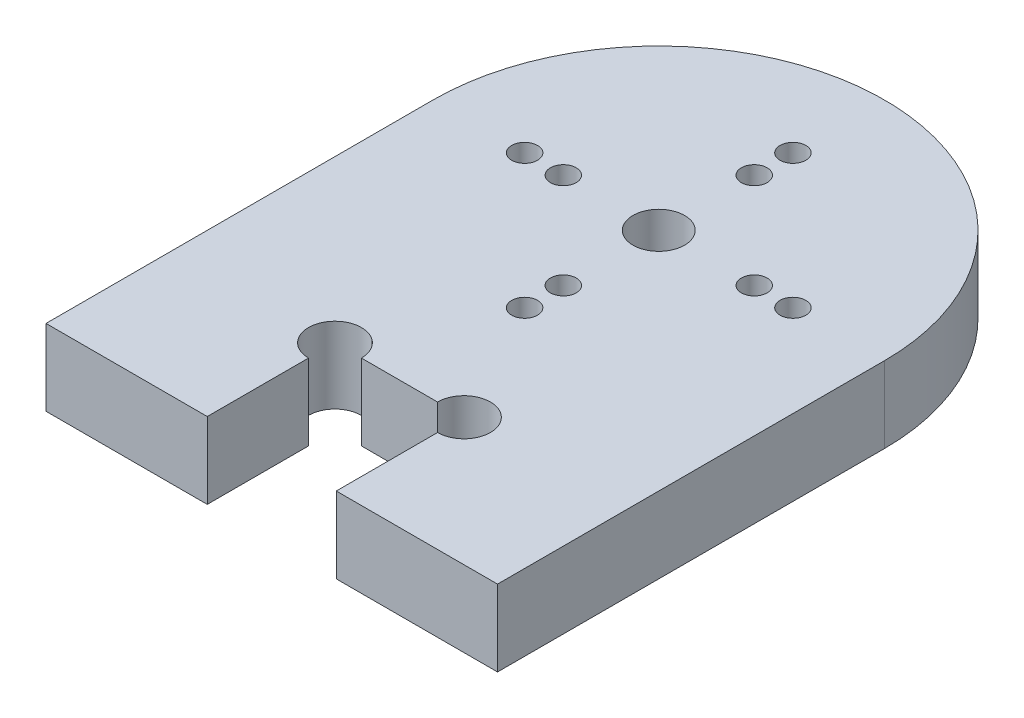
ISO-10303-21;
HEADER;
FILE_DESCRIPTION(('STEP AP214'),'2;1');
FILE_NAME('part.step','',(''),(''),'','','');
FILE_SCHEMA(('AUTOMOTIVE_DESIGN { 1 0 10303 214 1 1 1 1 }'));
ENDSEC;
DATA;
#1=APPLICATION_CONTEXT('core data for automotive mechanical design processes');
#2=APPLICATION_PROTOCOL_DEFINITION('international standard','automotive_design',2000,#1);
#3=PRODUCT_CONTEXT('',#1,'mechanical');
#4=PRODUCT('Part','Part','',(#3));
#5=PRODUCT_RELATED_PRODUCT_CATEGORY('part','',(#4));
#6=PRODUCT_DEFINITION_FORMATION('','',#4);
#7=PRODUCT_DEFINITION_CONTEXT('part definition',#1,'design');
#8=PRODUCT_DEFINITION('design','',#6,#7);
#9=PRODUCT_DEFINITION_SHAPE('','',#8);
#10=(LENGTH_UNIT() NAMED_UNIT(*) SI_UNIT(.MILLI.,.METRE.));
#11=(NAMED_UNIT(*) PLANE_ANGLE_UNIT() SI_UNIT($,.RADIAN.));
#12=(NAMED_UNIT(*) SI_UNIT($,.STERADIAN.) SOLID_ANGLE_UNIT());
#13=UNCERTAINTY_MEASURE_WITH_UNIT(LENGTH_MEASURE(1.E-05),#10,'distance_accuracy_value','');
#14=(GEOMETRIC_REPRESENTATION_CONTEXT(3) GLOBAL_UNCERTAINTY_ASSIGNED_CONTEXT((#13)) GLOBAL_UNIT_ASSIGNED_CONTEXT((#10,
#11,#12)) REPRESENTATION_CONTEXT('',''));
#15=CARTESIAN_POINT('',(0.,0.,0.));
#16=DIRECTION('',(0.,0.,1.));
#17=DIRECTION('',(1.,0.,0.));
#18=AXIS2_PLACEMENT_3D('',#15,#16,#17);
#19=CARTESIAN_POINT('',(0.,5.90000000000002,-12.5));
#20=DIRECTION('',(0.,-0.999999999999995,0.));
#21=DIRECTION('',(0.,0.,-0.999999999999995));
#22=AXIS2_PLACEMENT_3D('',#19,#20,#21);
#23=CYLINDRICAL_SURFACE('',#22,17.5);
#24=CARTESIAN_POINT('',(0.,0.,-12.5));
#25=DIRECTION('',(0.,0.999999999999995,0.));
#26=DIRECTION('',(0.,0.,0.999999999999995));
#27=AXIS2_PLACEMENT_3D('',#24,#25,#26);
#28=CIRCLE('',#27,17.5);
#29=CARTESIAN_POINT('',(17.5,1.27675647831893E-12,-12.5));
#30=VERTEX_POINT('',#29);
#31=CARTESIAN_POINT('',(-17.5,1.27675647831893E-12,-12.4999999999998));
#32=VERTEX_POINT('',#31);
#33=EDGE_CURVE('E189',#30,#32,#28,.T.);
#34=ORIENTED_EDGE('',*,*,#33,.T.);
#35=DIRECTION('',(0.,-0.999999999999995,0.));
#36=VECTOR('',#35,1.);
#37=CARTESIAN_POINT('',(-17.4999999999999,5.90000000000129,-12.4999999999998));
#38=LINE('',#37,#36);
#39=CARTESIAN_POINT('',(-17.4999999999999,5.90000000000129,-12.4999999999998));
#40=VERTEX_POINT('',#39);
#41=EDGE_CURVE('E211',#40,#32,#38,.T.);
#42=ORIENTED_EDGE('',*,*,#41,.F.);
#43=CARTESIAN_POINT('',(0.,5.90000000000002,-12.5));
#44=DIRECTION('',(0.,0.999999999999995,0.));
#45=DIRECTION('',(0.,0.,0.999999999999995));
#46=AXIS2_PLACEMENT_3D('',#43,#44,#45);
#47=CIRCLE('',#46,17.5);
#48=CARTESIAN_POINT('',(17.5000000000006,5.89999999999999,-12.5000000000001));
#49=VERTEX_POINT('',#48);
#50=EDGE_CURVE('E158',#49,#40,#47,.T.);
#51=ORIENTED_EDGE('',*,*,#50,.F.);
#52=DIRECTION('',(0.,-0.999999999999995,0.));
#53=VECTOR('',#52,1.);
#54=CARTESIAN_POINT('',(17.5000000000006,5.89999999999999,-12.5000000000001));
#55=LINE('',#54,#53);
#56=EDGE_CURVE('E179',#49,#30,#55,.T.);
#57=ORIENTED_EDGE('',*,*,#56,.T.);
#58=EDGE_LOOP('',(#34,#42,#51,#57));
#59=FACE_BOUND('',#58,.T.);
#60=ADVANCED_FACE('F38',(#59),#23,.T.);
#61=CARTESIAN_POINT('',(-17.5,5.90000000000129,0.));
#62=DIRECTION('',(1.,0.,0.));
#63=DIRECTION('',(0.,0.,-0.999999999999995));
#64=AXIS2_PLACEMENT_3D('',#61,#62,#63);
#65=PLANE('',#64);
#66=DIRECTION('',(0.,0.,0.999999999999995));
#67=VECTOR('',#66,1.);
#68=CARTESIAN_POINT('',(-17.5,1.27675647831893E-12,3.46944695195361E-13));
#69=LINE('',#68,#67);
#70=CARTESIAN_POINT('',(-17.5000000000003,2.55351295663786E-12,17.4999999999998));
#71=VERTEX_POINT('',#70);
#72=EDGE_CURVE('E192',#32,#71,#69,.T.);
#73=ORIENTED_EDGE('',*,*,#72,.T.);
#74=DIRECTION('',(0.,-0.999999999999995,0.));
#75=VECTOR('',#74,1.);
#76=CARTESIAN_POINT('',(-17.5,5.90000000000127,17.5));
#77=LINE('',#76,#75);
#78=CARTESIAN_POINT('',(-17.5,5.90000000000127,17.5));
#79=VERTEX_POINT('',#78);
#80=EDGE_CURVE('E227',#79,#71,#77,.T.);
#81=ORIENTED_EDGE('',*,*,#80,.F.);
#82=DIRECTION('',(0.,0.,0.999999999999995));
#83=VECTOR('',#82,1.);
#84=CARTESIAN_POINT('',(-17.5,5.90000000000129,0.));
#85=LINE('',#84,#83);
#86=EDGE_CURVE('E161',#40,#79,#85,.T.);
#87=ORIENTED_EDGE('',*,*,#86,.F.);
#88=ORIENTED_EDGE('',*,*,#41,.T.);
#89=EDGE_LOOP('',(#73,#81,#87,#88));
#90=FACE_BOUND('',#89,.T.);
#91=ADVANCED_FACE('F279',(#90),#65,.F.);
#92=CARTESIAN_POINT('',(-5.13478148889135E-13,5.90000000000046,-2.09999999999984));
#93=DIRECTION('',(0.,-0.999999999999995,0.));
#94=DIRECTION('',(0.,0.,-0.999999999999995));
#95=AXIS2_PLACEMENT_3D('',#92,#93,#94);
#96=CYLINDRICAL_SURFACE('',#95,1.);
#97=CARTESIAN_POINT('',(-5.13478148889135E-13,5.90000000000046,-2.09999999999984));
#98=DIRECTION('',(0.,0.999999999999995,0.));
#99=DIRECTION('',(0.,0.,0.999999999999995));
#100=AXIS2_PLACEMENT_3D('',#97,#98,#99);
#101=CIRCLE('',#100,1.);
#102=CARTESIAN_POINT('',(-5.13367126586672E-13,5.90000000000046,-1.09999999999984));
#103=VERTEX_POINT('',#102);
#104=EDGE_CURVE('E174',#103,#103,#101,.T.);
#105=ORIENTED_EDGE('',*,*,#104,.T.);
#106=EDGE_LOOP('',(#105));
#107=FACE_BOUND('',#106,.T.);
#108=CARTESIAN_POINT('',(0.,3.88578058618805E-13,-2.10000000000007));
#109=DIRECTION('',(0.,0.999999999999995,0.));
#110=DIRECTION('',(0.,0.,0.999999999999995));
#111=AXIS2_PLACEMENT_3D('',#108,#109,#110);
#112=CIRCLE('',#111,1.);
#113=CARTESIAN_POINT('',(0.,3.88604566996022E-13,-1.10000000000008));
#114=VERTEX_POINT('',#113);
#115=EDGE_CURVE('E205',#114,#114,#112,.T.);
#116=ORIENTED_EDGE('',*,*,#115,.F.);
#117=EDGE_LOOP('',(#116));
#118=FACE_BOUND('',#117,.T.);
#119=ADVANCED_FACE('F285',(#107,#118),#96,.F.);
#120=CARTESIAN_POINT('',(0.,5.89999999999999,-22.9));
#121=DIRECTION('',(0.,-0.999999999999995,0.));
#122=DIRECTION('',(0.,0.,-0.999999999999995));
#123=AXIS2_PLACEMENT_3D('',#120,#121,#122);
#124=CYLINDRICAL_SURFACE('',#123,1.);
#125=CARTESIAN_POINT('',(0.,5.89999999999999,-22.9));
#126=DIRECTION('',(0.,0.999999999999995,0.));
#127=DIRECTION('',(0.,0.,0.999999999999995));
#128=AXIS2_PLACEMENT_3D('',#125,#126,#127);
#129=CIRCLE('',#128,1.);
#130=CARTESIAN_POINT('',(0.,5.89999999999999,-21.9));
#131=VERTEX_POINT('',#130);
#132=EDGE_CURVE('E171',#131,#131,#129,.T.);
#133=ORIENTED_EDGE('',*,*,#132,.T.);
#134=EDGE_LOOP('',(#133));
#135=FACE_BOUND('',#134,.T.);
#136=CARTESIAN_POINT('',(0.,0.,-22.9));
#137=DIRECTION('',(0.,0.999999999999995,0.));
#138=DIRECTION('',(0.,0.,0.999999999999995));
#139=AXIS2_PLACEMENT_3D('',#136,#137,#138);
#140=CIRCLE('',#139,1.);
#141=CARTESIAN_POINT('',(0.,0.,-21.9));
#142=VERTEX_POINT('',#141);
#143=EDGE_CURVE('E202',#142,#142,#140,.T.);
#144=ORIENTED_EDGE('',*,*,#143,.F.);
#145=EDGE_LOOP('',(#144));
#146=FACE_BOUND('',#145,.T.);
#147=ADVANCED_FACE('F337',(#135,#146),#124,.F.);
#148=CARTESIAN_POINT('',(5.68989300120393E-13,5.89999999999999,-19.8999999999998));
#149=DIRECTION('',(0.,-0.999999999999995,0.));
#150=DIRECTION('',(0.,0.,-0.999999999999995));
#151=AXIS2_PLACEMENT_3D('',#148,#149,#150);
#152=CYLINDRICAL_SURFACE('',#151,1.);
#153=CARTESIAN_POINT('',(5.68989300120393E-13,5.89999999999999,-19.8999999999998));
#154=DIRECTION('',(0.,0.999999999999995,0.));
#155=DIRECTION('',(0.,0.,0.999999999999995));
#156=AXIS2_PLACEMENT_3D('',#153,#154,#155);
#157=CIRCLE('',#156,1.);
#158=CARTESIAN_POINT('',(5.69100322422855E-13,5.89999999999999,-18.8999999999998));
#159=VERTEX_POINT('',#158);
#160=EDGE_CURVE('E168',#159,#159,#157,.T.);
#161=ORIENTED_EDGE('',*,*,#160,.T.);
#162=EDGE_LOOP('',(#161));
#163=FACE_BOUND('',#162,.T.);
#164=CARTESIAN_POINT('',(0.,1.27675647831893E-12,-19.8999999999999));
#165=DIRECTION('',(0.,0.999999999999995,0.));
#166=DIRECTION('',(0.,0.,0.999999999999995));
#167=AXIS2_PLACEMENT_3D('',#164,#165,#166);
#168=CIRCLE('',#167,1.);
#169=CARTESIAN_POINT('',(0.,1.27678298669615E-12,-18.8999999999999));
#170=VERTEX_POINT('',#169);
#171=EDGE_CURVE('E199',#170,#170,#168,.T.);
#172=ORIENTED_EDGE('',*,*,#171,.F.);
#173=EDGE_LOOP('',(#172));
#174=FACE_BOUND('',#173,.T.);
#175=ADVANCED_FACE('F341',(#163,#174),#152,.F.);
#176=CARTESIAN_POINT('',(-10.3999999999997,5.90000000000127,-12.5000000000002));
#177=DIRECTION('',(0.,-0.999999999999995,0.));
#178=DIRECTION('',(0.,0.,-0.999999999999995));
#179=AXIS2_PLACEMENT_3D('',#176,#177,#178);
#180=CYLINDRICAL_SURFACE('',#179,0.999999999999999);
#181=CARTESIAN_POINT('',(-10.3999999999997,5.90000000000127,-12.5000000000002));
#182=DIRECTION('',(0.,0.999999999999995,0.));
#183=DIRECTION('',(0.,0.,0.999999999999995));
#184=AXIS2_PLACEMENT_3D('',#181,#182,#183);
#185=CIRCLE('',#184,0.999999999999999);
#186=CARTESIAN_POINT('',(-10.3999999999997,5.90000000000127,-11.5000000000002));
#187=VERTEX_POINT('',#186);
#188=EDGE_CURVE('E165',#187,#187,#185,.T.);
#189=ORIENTED_EDGE('',*,*,#188,.T.);
#190=EDGE_LOOP('',(#189));
#191=FACE_BOUND('',#190,.T.);
#192=CARTESIAN_POINT('',(-10.3999999999995,1.27675647831893E-12,-12.4999999999998));
#193=DIRECTION('',(0.,0.999999999999995,0.));
#194=DIRECTION('',(0.,0.,0.999999999999995));
#195=AXIS2_PLACEMENT_3D('',#192,#193,#194);
#196=CIRCLE('',#195,0.999999999999999);
#197=CARTESIAN_POINT('',(-10.3999999999995,1.27678298669615E-12,-11.4999999999998));
#198=VERTEX_POINT('',#197);
#199=EDGE_CURVE('E196',#198,#198,#196,.T.);
#200=ORIENTED_EDGE('',*,*,#199,.F.);
#201=EDGE_LOOP('',(#200));
#202=FACE_BOUND('',#201,.T.);
#203=ADVANCED_FACE('F345',(#191,#202),#180,.F.);
#204=CARTESIAN_POINT('',(17.5000000000001,5.89999999999999,-6.38378239159465E-13));
#205=DIRECTION('',(1.,0.,0.));
#206=DIRECTION('',(0.,0.,-0.999999999999995));
#207=AXIS2_PLACEMENT_3D('',#204,#205,#206);
#208=PLANE('',#207);
#209=DIRECTION('',(0.,0.,0.999999999999995));
#210=VECTOR('',#209,1.);
#211=CARTESIAN_POINT('',(17.5,1.27675647831893E-12,0.));
#212=LINE('',#211,#210);
#213=CARTESIAN_POINT('',(17.5,0.,17.5));
#214=VERTEX_POINT('',#213);
#215=EDGE_CURVE('E194',#30,#214,#212,.T.);
#216=ORIENTED_EDGE('',*,*,#215,.F.);
#217=ORIENTED_EDGE('',*,*,#56,.F.);
#218=DIRECTION('',(0.,0.,0.999999999999995));
#219=VECTOR('',#218,1.);
#220=CARTESIAN_POINT('',(17.5000000000001,5.89999999999999,-6.38378239159465E-13));
#221=LINE('',#220,#219);
#222=CARTESIAN_POINT('',(17.5,5.90000000000129,17.5000000000004));
#223=VERTEX_POINT('',#222);
#224=EDGE_CURVE('E163',#49,#223,#221,.T.);
#225=ORIENTED_EDGE('',*,*,#224,.T.);
#226=DIRECTION('',(0.,0.999999999999995,0.));
#227=VECTOR('',#226,1.);
#228=CARTESIAN_POINT('',(17.5,0.,17.5));
#229=LINE('',#228,#227);
#230=EDGE_CURVE('E250',#214,#223,#229,.T.);
#231=ORIENTED_EDGE('',*,*,#230,.F.);
#232=EDGE_LOOP('',(#216,#217,#225,#231));
#233=FACE_BOUND('',#232,.T.);
#234=ADVANCED_FACE('F294',(#233),#208,.T.);
#235=CARTESIAN_POINT('',(10.4,5.89999999999999,-12.5));
#236=DIRECTION('',(0.,-0.999999999999995,0.));
#237=DIRECTION('',(0.,0.,-0.999999999999995));
#238=AXIS2_PLACEMENT_3D('',#235,#236,#237);
#239=CYLINDRICAL_SURFACE('',#238,1.);
#240=CARTESIAN_POINT('',(10.4,5.89999999999999,-12.5));
#241=DIRECTION('',(0.,0.999999999999995,0.));
#242=DIRECTION('',(0.,0.,0.999999999999995));
#243=AXIS2_PLACEMENT_3D('',#240,#241,#242);
#244=CIRCLE('',#243,1.);
#245=CARTESIAN_POINT('',(10.4,5.89999999999999,-11.5));
#246=VERTEX_POINT('',#245);
#247=EDGE_CURVE('E155',#246,#246,#244,.T.);
#248=ORIENTED_EDGE('',*,*,#247,.T.);
#249=EDGE_LOOP('',(#248));
#250=FACE_BOUND('',#249,.T.);
#251=CARTESIAN_POINT('',(10.4000000000004,1.27675647831893E-12,-12.5000000000002));
#252=DIRECTION('',(0.,0.999999999999995,0.));
#253=DIRECTION('',(0.,0.,0.999999999999995));
#254=AXIS2_PLACEMENT_3D('',#251,#252,#253);
#255=CIRCLE('',#254,1.);
#256=CARTESIAN_POINT('',(10.4000000000004,1.27678298669615E-12,-11.5000000000002));
#257=VERTEX_POINT('',#256);
#258=EDGE_CURVE('E186',#257,#257,#255,.T.);
#259=ORIENTED_EDGE('',*,*,#258,.F.);
#260=EDGE_LOOP('',(#259));
#261=FACE_BOUND('',#260,.T.);
#262=ADVANCED_FACE('F290',(#250,#261),#239,.F.);
#263=CARTESIAN_POINT('',(7.39999999999999,5.89999999999999,-12.5));
#264=DIRECTION('',(0.,-0.999999999999995,0.));
#265=DIRECTION('',(0.,0.,-0.999999999999995));
#266=AXIS2_PLACEMENT_3D('',#263,#264,#265);
#267=CYLINDRICAL_SURFACE('',#266,1.);
#268=CARTESIAN_POINT('',(7.39999999999999,5.89999999999999,-12.5));
#269=DIRECTION('',(0.,0.999999999999995,0.));
#270=DIRECTION('',(0.,0.,0.999999999999995));
#271=AXIS2_PLACEMENT_3D('',#268,#269,#270);
#272=CIRCLE('',#271,1.);
#273=CARTESIAN_POINT('',(7.39999999999999,5.89999999999999,-11.5));
#274=VERTEX_POINT('',#273);
#275=EDGE_CURVE('E152',#274,#274,#272,.T.);
#276=ORIENTED_EDGE('',*,*,#275,.T.);
#277=EDGE_LOOP('',(#276));
#278=FACE_BOUND('',#277,.T.);
#279=CARTESIAN_POINT('',(7.4,1.27675647831893E-12,-12.5000000000002));
#280=DIRECTION('',(0.,0.999999999999995,0.));
#281=DIRECTION('',(0.,0.,0.999999999999995));
#282=AXIS2_PLACEMENT_3D('',#279,#280,#281);
#283=CIRCLE('',#282,1.);
#284=CARTESIAN_POINT('',(7.4,1.27678298669615E-12,-11.5000000000002));
#285=VERTEX_POINT('',#284);
#286=EDGE_CURVE('E183',#285,#285,#283,.T.);
#287=ORIENTED_EDGE('',*,*,#286,.F.);
#288=EDGE_LOOP('',(#287));
#289=FACE_BOUND('',#288,.T.);
#290=ADVANCED_FACE('F293',(#278,#289),#267,.F.);
#291=CARTESIAN_POINT('',(0.,5.90000000000002,-12.5));
#292=DIRECTION('',(0.,-0.999999999999995,0.));
#293=DIRECTION('',(0.,0.,-0.999999999999995));
#294=AXIS2_PLACEMENT_3D('',#291,#292,#293);
#295=CYLINDRICAL_SURFACE('',#294,2.);
#296=CARTESIAN_POINT('',(0.,5.90000000000002,-12.5));
#297=DIRECTION('',(0.,0.999999999999995,0.));
#298=DIRECTION('',(0.,0.,0.999999999999995));
#299=AXIS2_PLACEMENT_3D('',#296,#297,#298);
#300=CIRCLE('',#299,2.);
#301=CARTESIAN_POINT('',(0.,5.90000000000002,-10.5));
#302=VERTEX_POINT('',#301);
#303=EDGE_CURVE('E148',#302,#302,#300,.T.);
#304=ORIENTED_EDGE('',*,*,#303,.T.);
#305=EDGE_LOOP('',(#304));
#306=FACE_BOUND('',#305,.T.);
#307=CARTESIAN_POINT('',(0.,0.,-12.5));
#308=DIRECTION('',(0.,0.999999999999995,0.));
#309=DIRECTION('',(0.,0.,0.999999999999995));
#310=AXIS2_PLACEMENT_3D('',#307,#308,#309);
#311=CIRCLE('',#310,2.);
#312=CARTESIAN_POINT('',(0.,0.,-10.5));
#313=VERTEX_POINT('',#312);
#314=EDGE_CURVE('E139',#313,#313,#311,.T.);
#315=ORIENTED_EDGE('',*,*,#314,.F.);
#316=EDGE_LOOP('',(#315));
#317=FACE_BOUND('',#316,.T.);
#318=ADVANCED_FACE('F297',(#306,#317),#295,.F.);
#319=CARTESIAN_POINT('',(-7.39999999999999,5.90000000000129,-12.4999999999999));
#320=DIRECTION('',(0.,-0.999999999999995,0.));
#321=DIRECTION('',(0.,0.,-0.999999999999995));
#322=AXIS2_PLACEMENT_3D('',#319,#320,#321);
#323=CYLINDRICAL_SURFACE('',#322,0.999999999999999);
#324=CARTESIAN_POINT('',(-7.39999999999999,5.90000000000129,-12.4999999999999));
#325=DIRECTION('',(0.,0.999999999999995,0.));
#326=DIRECTION('',(0.,0.,0.999999999999995));
#327=AXIS2_PLACEMENT_3D('',#324,#325,#326);
#328=CIRCLE('',#327,0.999999999999999);
#329=CARTESIAN_POINT('',(-7.39999999999999,5.90000000000129,-11.4999999999999));
#330=VERTEX_POINT('',#329);
#331=EDGE_CURVE('E145',#330,#330,#328,.T.);
#332=ORIENTED_EDGE('',*,*,#331,.T.);
#333=EDGE_LOOP('',(#332));
#334=FACE_BOUND('',#333,.T.);
#335=CARTESIAN_POINT('',(-7.4,1.27675647831893E-12,-12.4999999999995));
#336=DIRECTION('',(0.,0.999999999999995,0.));
#337=DIRECTION('',(0.,0.,0.999999999999995));
#338=AXIS2_PLACEMENT_3D('',#335,#336,#337);
#339=CIRCLE('',#338,0.999999999999999);
#340=CARTESIAN_POINT('',(-7.4,1.27678298669615E-12,-11.4999999999995));
#341=VERTEX_POINT('',#340);
#342=EDGE_CURVE('E135',#341,#341,#339,.T.);
#343=ORIENTED_EDGE('',*,*,#342,.F.);
#344=EDGE_LOOP('',(#343));
#345=FACE_BOUND('',#344,.T.);
#346=ADVANCED_FACE('F40',(#334,#345),#323,.F.);
#347=CARTESIAN_POINT('',(5.96744875736022E-13,5.90000000000127,-5.1000000000002));
#348=DIRECTION('',(0.,-0.999999999999995,0.));
#349=DIRECTION('',(0.,0.,-0.999999999999995));
#350=AXIS2_PLACEMENT_3D('',#347,#348,#349);
#351=CYLINDRICAL_SURFACE('',#350,1.);
#352=CARTESIAN_POINT('',(5.96744875736022E-13,5.90000000000127,-5.1000000000002));
#353=DIRECTION('',(0.,0.999999999999995,0.));
#354=DIRECTION('',(0.,0.,0.999999999999995));
#355=AXIS2_PLACEMENT_3D('',#352,#353,#354);
#356=CIRCLE('',#355,1.);
#357=CARTESIAN_POINT('',(5.96855898038484E-13,5.90000000000127,-4.10000000000021));
#358=VERTEX_POINT('',#357);
#359=EDGE_CURVE('E177',#358,#358,#356,.T.);
#360=ORIENTED_EDGE('',*,*,#359,.T.);
#361=EDGE_LOOP('',(#360));
#362=FACE_BOUND('',#361,.T.);
#363=CARTESIAN_POINT('',(0.,0.,-5.09999999999999));
#364=DIRECTION('',(0.,0.999999999999995,0.));
#365=DIRECTION('',(0.,0.,0.999999999999995));
#366=AXIS2_PLACEMENT_3D('',#363,#364,#365);
#367=CIRCLE('',#366,1.);
#368=CARTESIAN_POINT('',(0.,0.,-4.1));
#369=VERTEX_POINT('',#368);
#370=EDGE_CURVE('E149',#369,#369,#367,.T.);
#371=ORIENTED_EDGE('',*,*,#370,.F.);
#372=EDGE_LOOP('',(#371));
#373=FACE_BOUND('',#372,.T.);
#374=ADVANCED_FACE('F304',(#362,#373),#351,.F.);
#375=CARTESIAN_POINT('',(0.,5.90000000000002,0.));
#376=DIRECTION('',(0.,0.999999999999995,0.));
#377=DIRECTION('',(0.,0.,0.999999999999995));
#378=AXIS2_PLACEMENT_3D('',#375,#376,#377);
#379=PLANE('',#378);
#380=CARTESIAN_POINT('',(-4.99999999999937,5.90000000000002,7.60000000000004));
#381=DIRECTION('',(0.,0.999999999999995,0.));
#382=DIRECTION('',(0.,0.,0.999999999999995));
#383=AXIS2_PLACEMENT_3D('',#380,#381,#382);
#384=CIRCLE('',#383,2.05);
#385=CARTESIAN_POINT('',(-2.94999999999992,5.90000000000127,7.60000000000016));
#386=VERTEX_POINT('',#385);
#387=CARTESIAN_POINT('',(-5.00000000000063,5.89999999999999,9.65000000000002));
#388=VERTEX_POINT('',#387);
#389=EDGE_CURVE('E113',#386,#388,#384,.T.);
#390=ORIENTED_EDGE('',*,*,#389,.F.);
#391=DIRECTION('',(-1.,0.,0.));
#392=VECTOR('',#391,1.);
#393=CARTESIAN_POINT('',(-4.99999999999937,5.90000000000002,7.60000000000004));
#394=LINE('',#393,#392);
#395=CARTESIAN_POINT('',(2.94999999999998,5.90000000000002,7.60000000000001));
#396=VERTEX_POINT('',#395);
#397=EDGE_CURVE('E136',#396,#386,#394,.T.);
#398=ORIENTED_EDGE('',*,*,#397,.F.);
#399=CARTESIAN_POINT('',(5.00000000000002,5.90000000000127,7.59999999999984));
#400=DIRECTION('',(0.,0.999999999999995,0.));
#401=DIRECTION('',(0.,0.,0.999999999999995));
#402=AXIS2_PLACEMENT_3D('',#399,#400,#401);
#403=CIRCLE('',#402,2.05);
#404=CARTESIAN_POINT('',(4.99999999999999,5.90000000000127,9.64999999999976));
#405=VERTEX_POINT('',#404);
#406=EDGE_CURVE('E61',#405,#396,#403,.T.);
#407=ORIENTED_EDGE('',*,*,#406,.F.);
#408=DIRECTION('',(0.,0.,-0.999999999999995));
#409=VECTOR('',#408,1.);
#410=CARTESIAN_POINT('',(5.,5.90000000000129,19.4));
#411=LINE('',#410,#409);
#412=CARTESIAN_POINT('',(4.99999999999999,5.90000000000127,17.5));
#413=VERTEX_POINT('',#412);
#414=EDGE_CURVE('E141',#413,#405,#411,.T.);
#415=ORIENTED_EDGE('',*,*,#414,.F.);
#416=DIRECTION('',(-1.,0.,0.));
#417=VECTOR('',#416,1.);
#418=CARTESIAN_POINT('',(17.5,5.90000000000129,17.5000000000004));
#419=LINE('',#418,#417);
#420=EDGE_CURVE('E243',#223,#413,#419,.T.);
#421=ORIENTED_EDGE('',*,*,#420,.F.);
#422=ORIENTED_EDGE('',*,*,#224,.F.);
#423=ORIENTED_EDGE('',*,*,#50,.T.);
#424=ORIENTED_EDGE('',*,*,#86,.T.);
#425=DIRECTION('',(-1.,0.,0.));
#426=VECTOR('',#425,1.);
#427=CARTESIAN_POINT('',(-4.99999999999999,5.90000000000127,17.5));
#428=LINE('',#427,#426);
#429=CARTESIAN_POINT('',(-4.99999999999999,5.90000000000127,17.5));
#430=VERTEX_POINT('',#429);
#431=EDGE_CURVE('E134',#430,#79,#428,.T.);
#432=ORIENTED_EDGE('',*,*,#431,.F.);
#433=DIRECTION('',(0.,0.,0.999999999999995));
#434=VECTOR('',#433,1.);
#435=CARTESIAN_POINT('',(-5.,5.90000000000129,19.4));
#436=LINE('',#435,#434);
#437=EDGE_CURVE('E127',#388,#430,#436,.T.);
#438=ORIENTED_EDGE('',*,*,#437,.F.);
#439=EDGE_LOOP('',(#390,#398,#407,#415,#421,#422,#423,#424,#432,#438));
#440=FACE_BOUND('',#439,.T.);
#441=ORIENTED_EDGE('',*,*,#331,.F.);
#442=EDGE_LOOP('',(#441));
#443=FACE_BOUND('',#442,.T.);
#444=ORIENTED_EDGE('',*,*,#303,.F.);
#445=EDGE_LOOP('',(#444));
#446=FACE_BOUND('',#445,.T.);
#447=ORIENTED_EDGE('',*,*,#275,.F.);
#448=EDGE_LOOP('',(#447));
#449=FACE_BOUND('',#448,.T.);
#450=ORIENTED_EDGE('',*,*,#247,.F.);
#451=EDGE_LOOP('',(#450));
#452=FACE_BOUND('',#451,.T.);
#453=ORIENTED_EDGE('',*,*,#188,.F.);
#454=EDGE_LOOP('',(#453));
#455=FACE_BOUND('',#454,.T.);
#456=ORIENTED_EDGE('',*,*,#160,.F.);
#457=EDGE_LOOP('',(#456));
#458=FACE_BOUND('',#457,.T.);
#459=ORIENTED_EDGE('',*,*,#132,.F.);
#460=EDGE_LOOP('',(#459));
#461=FACE_BOUND('',#460,.T.);
#462=ORIENTED_EDGE('',*,*,#104,.F.);
#463=EDGE_LOOP('',(#462));
#464=FACE_BOUND('',#463,.T.);
#465=ORIENTED_EDGE('',*,*,#359,.F.);
#466=EDGE_LOOP('',(#465));
#467=FACE_BOUND('',#466,.T.);
#468=ADVANCED_FACE('F131',(#440,#443,#446,#449,#452,#455,#458,#461,#464,#467),#379,.T.);
#469=CARTESIAN_POINT('',(0.,0.,0.));
#470=DIRECTION('',(0.,0.999999999999995,0.));
#471=DIRECTION('',(0.,0.,0.999999999999995));
#472=AXIS2_PLACEMENT_3D('',#469,#470,#471);
#473=PLANE('',#472);
#474=DIRECTION('',(-1.,0.,0.));
#475=VECTOR('',#474,1.);
#476=CARTESIAN_POINT('',(5.96744875736022E-13,1.38777878078145E-13,7.59999999999973));
#477=LINE('',#476,#475);
#478=CARTESIAN_POINT('',(2.94999999999999,0.,7.60000000000001));
#479=VERTEX_POINT('',#478);
#480=CARTESIAN_POINT('',(-2.94999999999999,1.27675647831893E-12,7.59999999999988));
#481=VERTEX_POINT('',#480);
#482=EDGE_CURVE('E214',#479,#481,#477,.T.);
#483=ORIENTED_EDGE('',*,*,#482,.T.);
#484=CARTESIAN_POINT('',(-4.99999999999999,0.,7.60000000000001));
#485=DIRECTION('',(0.,0.999999999999995,0.));
#486=DIRECTION('',(0.,0.,0.999999999999995));
#487=AXIS2_PLACEMENT_3D('',#484,#485,#486);
#488=CIRCLE('',#487,2.05);
#489=CARTESIAN_POINT('',(-5.00000000000027,1.0547118733939E-12,9.64999999999967));
#490=VERTEX_POINT('',#489);
#491=EDGE_CURVE('E53',#490,#481,#488,.F.);
#492=ORIENTED_EDGE('',*,*,#491,.F.);
#493=DIRECTION('',(0.,0.,0.999999999999995));
#494=VECTOR('',#493,1.);
#495=CARTESIAN_POINT('',(-5.,0.,0.));
#496=LINE('',#495,#494);
#497=CARTESIAN_POINT('',(-4.99999999999999,0.,17.5));
#498=VERTEX_POINT('',#497);
#499=EDGE_CURVE('E46',#490,#498,#496,.T.);
#500=ORIENTED_EDGE('',*,*,#499,.T.);
#501=DIRECTION('',(1.,0.,0.));
#502=VECTOR('',#501,1.);
#503=CARTESIAN_POINT('',(-17.5000000000003,2.55351295663786E-12,17.4999999999998));
#504=LINE('',#503,#502);
#505=EDGE_CURVE('E221',#71,#498,#504,.T.);
#506=ORIENTED_EDGE('',*,*,#505,.F.);
#507=ORIENTED_EDGE('',*,*,#72,.F.);
#508=ORIENTED_EDGE('',*,*,#33,.F.);
#509=ORIENTED_EDGE('',*,*,#215,.T.);
#510=DIRECTION('',(1.,0.,0.));
#511=VECTOR('',#510,1.);
#512=CARTESIAN_POINT('',(5.,9.71445146547012E-13,17.5000000000001));
#513=LINE('',#512,#511);
#514=CARTESIAN_POINT('',(5.,9.71445146547012E-13,17.5000000000001));
#515=VERTEX_POINT('',#514);
#516=EDGE_CURVE('E253',#515,#214,#513,.T.);
#517=ORIENTED_EDGE('',*,*,#516,.F.);
#518=DIRECTION('',(0.,0.,-0.999999999999995));
#519=VECTOR('',#518,1.);
#520=CARTESIAN_POINT('',(4.99999999999966,1.27675647831893E-12,4.16333634234434E-13));
#521=LINE('',#520,#519);
#522=CARTESIAN_POINT('',(4.99999999999937,1.27675647831893E-12,9.65000000000012));
#523=VERTEX_POINT('',#522);
#524=EDGE_CURVE('E11',#515,#523,#521,.T.);
#525=ORIENTED_EDGE('',*,*,#524,.T.);
#526=CARTESIAN_POINT('',(5.00000000000007,1.13797860024079E-12,7.59999999999959));
#527=DIRECTION('',(0.,0.999999999999995,0.));
#528=DIRECTION('',(0.,0.,0.999999999999995));
#529=AXIS2_PLACEMENT_3D('',#526,#527,#528);
#530=CIRCLE('',#529,2.05);
#531=EDGE_CURVE('E261',#479,#523,#530,.F.);
#532=ORIENTED_EDGE('',*,*,#531,.F.);
#533=EDGE_LOOP('',(#483,#492,#500,#506,#507,#508,#509,#517,#525,#532));
#534=FACE_BOUND('',#533,.T.);
#535=ORIENTED_EDGE('',*,*,#342,.T.);
#536=EDGE_LOOP('',(#535));
#537=FACE_BOUND('',#536,.T.);
#538=ORIENTED_EDGE('',*,*,#314,.T.);
#539=EDGE_LOOP('',(#538));
#540=FACE_BOUND('',#539,.T.);
#541=ORIENTED_EDGE('',*,*,#286,.T.);
#542=EDGE_LOOP('',(#541));
#543=FACE_BOUND('',#542,.T.);
#544=ORIENTED_EDGE('',*,*,#258,.T.);
#545=EDGE_LOOP('',(#544));
#546=FACE_BOUND('',#545,.T.);
#547=ORIENTED_EDGE('',*,*,#199,.T.);
#548=EDGE_LOOP('',(#547));
#549=FACE_BOUND('',#548,.T.);
#550=ORIENTED_EDGE('',*,*,#171,.T.);
#551=EDGE_LOOP('',(#550));
#552=FACE_BOUND('',#551,.T.);
#553=ORIENTED_EDGE('',*,*,#143,.T.);
#554=EDGE_LOOP('',(#553));
#555=FACE_BOUND('',#554,.T.);
#556=ORIENTED_EDGE('',*,*,#115,.T.);
#557=EDGE_LOOP('',(#556));
#558=FACE_BOUND('',#557,.T.);
#559=ORIENTED_EDGE('',*,*,#370,.T.);
#560=EDGE_LOOP('',(#559));
#561=FACE_BOUND('',#560,.T.);
#562=ADVANCED_FACE('F219',(#534,#537,#540,#543,#546,#549,#552,#555,#558,#561),#473,.F.);
#563=CARTESIAN_POINT('',(4.99999999999999,-4.09999999999999,19.4));
#564=DIRECTION('',(1.,0.,0.));
#565=DIRECTION('',(0.,0.,-0.999999999999995));
#566=AXIS2_PLACEMENT_3D('',#563,#564,#565);
#567=PLANE('',#566);
#568=ORIENTED_EDGE('',*,*,#414,.T.);
#569=DIRECTION('',(0.,0.999999999999995,0.));
#570=VECTOR('',#569,1.);
#571=CARTESIAN_POINT('',(4.99999999999982,-0.000999999998724244,9.64999999999973));
#572=LINE('',#571,#570);
#573=EDGE_CURVE('E237',#523,#405,#572,.T.);
#574=ORIENTED_EDGE('',*,*,#573,.F.);
#575=ORIENTED_EDGE('',*,*,#524,.F.);
#576=DIRECTION('',(0.,-0.999999999999995,0.));
#577=VECTOR('',#576,1.);
#578=CARTESIAN_POINT('',(4.99999999999999,5.90000000000127,17.5));
#579=LINE('',#578,#577);
#580=EDGE_CURVE('E239',#413,#515,#579,.T.);
#581=ORIENTED_EDGE('',*,*,#580,.F.);
#582=EDGE_LOOP('',(#568,#574,#575,#581));
#583=FACE_BOUND('',#582,.T.);
#584=ADVANCED_FACE('F236',(#583),#567,.F.);
#585=CARTESIAN_POINT('',(-5.00000000000012,-4.0999999999998,19.3999999999994));
#586=DIRECTION('',(-1.,0.,0.));
#587=DIRECTION('',(0.,0.,0.999999999999995));
#588=AXIS2_PLACEMENT_3D('',#585,#586,#587);
#589=PLANE('',#588);
#590=ORIENTED_EDGE('',*,*,#499,.F.);
#591=DIRECTION('',(0.,0.999999999999995,0.));
#592=VECTOR('',#591,1.);
#593=CARTESIAN_POINT('',(-5.,-0.001000000000001,9.64999999999999));
#594=LINE('',#593,#592);
#595=EDGE_CURVE('E116',#388,#490,#594,.F.);
#596=ORIENTED_EDGE('',*,*,#595,.F.);
#597=ORIENTED_EDGE('',*,*,#437,.T.);
#598=DIRECTION('',(0.,0.999999999999995,0.));
#599=VECTOR('',#598,1.);
#600=CARTESIAN_POINT('',(-4.99999999999999,0.,17.5));
#601=LINE('',#600,#599);
#602=EDGE_CURVE('E225',#498,#430,#601,.T.);
#603=ORIENTED_EDGE('',*,*,#602,.F.);
#604=EDGE_LOOP('',(#590,#596,#597,#603));
#605=FACE_BOUND('',#604,.T.);
#606=ADVANCED_FACE('F125',(#605),#589,.F.);
#607=CARTESIAN_POINT('',(-5.,-4.09999999999999,7.6));
#608=DIRECTION('',(0.,0.,-0.999999999999995));
#609=DIRECTION('',(-1.,0.,0.));
#610=AXIS2_PLACEMENT_3D('',#607,#608,#609);
#611=PLANE('',#610);
#612=ORIENTED_EDGE('',*,*,#397,.T.);
#613=DIRECTION('',(0.,0.999999999999995,0.));
#614=VECTOR('',#613,1.);
#615=CARTESIAN_POINT('',(-2.94999999999999,-0.000999999998724244,7.60000000000033));
#616=LINE('',#615,#614);
#617=EDGE_CURVE('E117',#481,#386,#616,.T.);
#618=ORIENTED_EDGE('',*,*,#617,.F.);
#619=ORIENTED_EDGE('',*,*,#482,.F.);
#620=DIRECTION('',(0.,0.999999999999995,0.));
#621=VECTOR('',#620,1.);
#622=CARTESIAN_POINT('',(2.94999999999979,-0.000999999999362622,7.59999999999944));
#623=LINE('',#622,#621);
#624=EDGE_CURVE('E257',#396,#479,#623,.F.);
#625=ORIENTED_EDGE('',*,*,#624,.F.);
#626=EDGE_LOOP('',(#612,#618,#619,#625));
#627=FACE_BOUND('',#626,.T.);
#628=ADVANCED_FACE('F268',(#627),#611,.F.);
#629=CARTESIAN_POINT('',(0.,0.,17.5));
#630=DIRECTION('',(0.,0.,0.999999999999995));
#631=DIRECTION('',(1.,0.,0.));
#632=AXIS2_PLACEMENT_3D('',#629,#630,#631);
#633=PLANE('',#632);
#634=ORIENTED_EDGE('',*,*,#80,.T.);
#635=ORIENTED_EDGE('',*,*,#505,.T.);
#636=ORIENTED_EDGE('',*,*,#602,.T.);
#637=ORIENTED_EDGE('',*,*,#431,.T.);
#638=EDGE_LOOP('',(#634,#635,#636,#637));
#639=FACE_BOUND('',#638,.T.);
#640=ADVANCED_FACE('F224',(#639),#633,.T.);
#641=CARTESIAN_POINT('',(0.,0.,17.5));
#642=DIRECTION('',(0.,0.,0.999999999999995));
#643=DIRECTION('',(1.,0.,0.));
#644=AXIS2_PLACEMENT_3D('',#641,#642,#643);
#645=PLANE('',#644);
#646=ORIENTED_EDGE('',*,*,#230,.T.);
#647=ORIENTED_EDGE('',*,*,#420,.T.);
#648=ORIENTED_EDGE('',*,*,#580,.T.);
#649=ORIENTED_EDGE('',*,*,#516,.T.);
#650=EDGE_LOOP('',(#646,#647,#648,#649));
#651=FACE_BOUND('',#650,.T.);
#652=ADVANCED_FACE('F246',(#651),#645,.T.);
#653=CARTESIAN_POINT('',(5.00000000000061,-0.000999999998724244,7.60000000000023));
#654=DIRECTION('',(0.,0.999999999999995,0.));
#655=DIRECTION('',(0.,0.,0.999999999999995));
#656=AXIS2_PLACEMENT_3D('',#653,#654,#655);
#657=CYLINDRICAL_SURFACE('',#656,2.05);
#658=ORIENTED_EDGE('',*,*,#573,.T.);
#659=ORIENTED_EDGE('',*,*,#406,.T.);
#660=ORIENTED_EDGE('',*,*,#624,.T.);
#661=ORIENTED_EDGE('',*,*,#531,.T.);
#662=EDGE_LOOP('',(#658,#659,#660,#661));
#663=FACE_BOUND('',#662,.T.);
#664=ADVANCED_FACE('F265',(#663),#657,.F.);
#665=CARTESIAN_POINT('',(-4.99999999999999,-0.000999999998724244,7.59999999999995));
#666=DIRECTION('',(0.,0.999999999999995,0.));
#667=DIRECTION('',(0.,0.,0.999999999999995));
#668=AXIS2_PLACEMENT_3D('',#665,#666,#667);
#669=CYLINDRICAL_SURFACE('',#668,2.05);
#670=ORIENTED_EDGE('',*,*,#595,.T.);
#671=ORIENTED_EDGE('',*,*,#491,.T.);
#672=ORIENTED_EDGE('',*,*,#617,.T.);
#673=ORIENTED_EDGE('',*,*,#389,.T.);
#674=EDGE_LOOP('',(#670,#671,#672,#673));
#675=FACE_BOUND('',#674,.T.);
#676=ADVANCED_FACE('F115',(#675),#669,.F.);
#677=CLOSED_SHELL('',(#60,#91,#119,#147,#175,#203,#234,#262,#290,#318,#346,#374,#468,#562,#584,
#606,#628,#640,#652,#664,#676));
#678=MANIFOLD_SOLID_BREP('B2',#677);
#679=ADVANCED_BREP_SHAPE_REPRESENTATION('',(#18,#678),#14);
#680=SHAPE_DEFINITION_REPRESENTATION(#9,#679);
ENDSEC;
END-ISO-10303-21;
